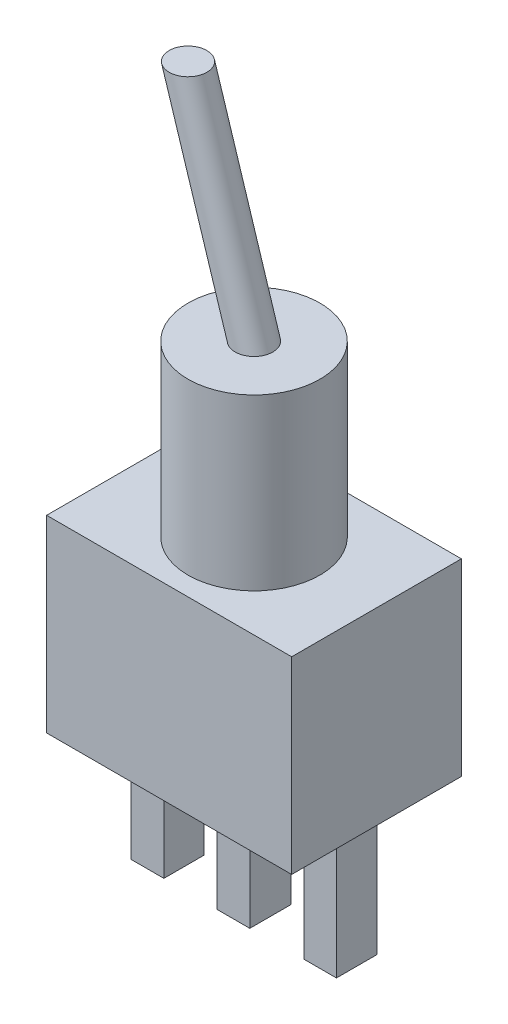
ISO-10303-21;
HEADER;
FILE_DESCRIPTION(('STEP AP214'),'2;1');
FILE_NAME('part.step','',(''),(''),'','','');
FILE_SCHEMA(('AUTOMOTIVE_DESIGN { 1 0 10303 214 1 1 1 1 }'));
ENDSEC;
DATA;
#1=APPLICATION_CONTEXT('core data for automotive mechanical design processes');
#2=APPLICATION_PROTOCOL_DEFINITION('international standard','automotive_design',2000,#1);
#3=PRODUCT_CONTEXT('',#1,'mechanical');
#4=PRODUCT('Part','Part','',(#3));
#5=PRODUCT_RELATED_PRODUCT_CATEGORY('part','',(#4));
#6=PRODUCT_DEFINITION_FORMATION('','',#4);
#7=PRODUCT_DEFINITION_CONTEXT('part definition',#1,'design');
#8=PRODUCT_DEFINITION('design','',#6,#7);
#9=PRODUCT_DEFINITION_SHAPE('','',#8);
#10=(LENGTH_UNIT() NAMED_UNIT(*) SI_UNIT(.MILLI.,.METRE.));
#11=(NAMED_UNIT(*) PLANE_ANGLE_UNIT() SI_UNIT($,.RADIAN.));
#12=(NAMED_UNIT(*) SI_UNIT($,.STERADIAN.) SOLID_ANGLE_UNIT());
#13=UNCERTAINTY_MEASURE_WITH_UNIT(LENGTH_MEASURE(1.E-05),#10,'distance_accuracy_value','');
#14=(GEOMETRIC_REPRESENTATION_CONTEXT(3) GLOBAL_UNCERTAINTY_ASSIGNED_CONTEXT((#13)) GLOBAL_UNIT_ASSIGNED_CONTEXT((#10,
#11,#12)) REPRESENTATION_CONTEXT('',''));
#15=CARTESIAN_POINT('',(0.,0.,0.));
#16=DIRECTION('',(0.,0.,1.));
#17=DIRECTION('',(1.,0.,0.));
#18=AXIS2_PLACEMENT_3D('',#15,#16,#17);
#19=CARTESIAN_POINT('',(0.,0.,0.));
#20=DIRECTION('',(0.,1.,0.));
#21=DIRECTION('',(0.,0.,1.));
#22=AXIS2_PLACEMENT_3D('',#19,#20,#21);
#23=PLANE('',#22);
#24=DIRECTION('',(0.,0.,1.));
#25=VECTOR('',#24,1.);
#26=CARTESIAN_POINT('',(-3.71007204412239,0.,1.06976152914244));
#27=LINE('',#26,#25);
#28=CARTESIAN_POINT('',(-3.71007204412239,0.,-1.06976152914244));
#29=VERTEX_POINT('',#28);
#30=CARTESIAN_POINT('',(-3.71007204412239,0.,1.06976152914244));
#31=VERTEX_POINT('',#30);
#32=EDGE_CURVE('E170',#29,#31,#27,.T.);
#33=ORIENTED_EDGE('',*,*,#32,.F.);
#34=DIRECTION('',(1.,0.,0.));
#35=VECTOR('',#34,1.);
#36=CARTESIAN_POINT('',(-3.71007204412239,0.,-1.06976152914244));
#37=LINE('',#36,#35);
#38=CARTESIAN_POINT('',(-5.44316480419965,0.,-1.06976152914244));
#39=VERTEX_POINT('',#38);
#40=EDGE_CURVE('E183',#39,#29,#37,.T.);
#41=ORIENTED_EDGE('',*,*,#40,.F.);
#42=DIRECTION('',(0.,0.,-1.));
#43=VECTOR('',#42,1.);
#44=CARTESIAN_POINT('',(-5.44316480419965,0.,1.06976152914244));
#45=LINE('',#44,#43);
#46=CARTESIAN_POINT('',(-5.44316480419965,0.,1.06976152914244));
#47=VERTEX_POINT('',#46);
#48=EDGE_CURVE('E192',#47,#39,#45,.T.);
#49=ORIENTED_EDGE('',*,*,#48,.F.);
#50=DIRECTION('',(-1.,0.,0.));
#51=VECTOR('',#50,1.);
#52=CARTESIAN_POINT('',(-3.71007204412239,0.,1.06976152914244));
#53=LINE('',#52,#51);
#54=EDGE_CURVE('E173',#31,#47,#53,.T.);
#55=ORIENTED_EDGE('',*,*,#54,.F.);
#56=EDGE_LOOP('',(#33,#41,#49,#55));
#57=FACE_BOUND('',#56,.T.);
#58=DIRECTION('',(0.,0.,-1.));
#59=VECTOR('',#58,1.);
#60=CARTESIAN_POINT('',(6.5,0.,-4.5));
#61=LINE('',#60,#59);
#62=CARTESIAN_POINT('',(6.5,0.,4.5));
#63=VERTEX_POINT('',#62);
#64=CARTESIAN_POINT('',(6.5,0.,-4.5));
#65=VERTEX_POINT('',#64);
#66=EDGE_CURVE('E247',#63,#65,#61,.T.);
#67=ORIENTED_EDGE('',*,*,#66,.F.);
#68=DIRECTION('',(1.,0.,0.));
#69=VECTOR('',#68,1.);
#70=CARTESIAN_POINT('',(-6.5,0.,4.5));
#71=LINE('',#70,#69);
#72=CARTESIAN_POINT('',(-6.5,0.,4.5));
#73=VERTEX_POINT('',#72);
#74=EDGE_CURVE('E254',#73,#63,#71,.T.);
#75=ORIENTED_EDGE('',*,*,#74,.F.);
#76=DIRECTION('',(0.,0.,1.));
#77=VECTOR('',#76,1.);
#78=CARTESIAN_POINT('',(-6.5,0.,-4.5));
#79=LINE('',#78,#77);
#80=CARTESIAN_POINT('',(-6.5,0.,-4.5));
#81=VERTEX_POINT('',#80);
#82=EDGE_CURVE('E265',#81,#73,#79,.T.);
#83=ORIENTED_EDGE('',*,*,#82,.F.);
#84=DIRECTION('',(-1.,0.,0.));
#85=VECTOR('',#84,1.);
#86=CARTESIAN_POINT('',(-6.5,0.,-4.5));
#87=LINE('',#86,#85);
#88=EDGE_CURVE('E263',#65,#81,#87,.T.);
#89=ORIENTED_EDGE('',*,*,#88,.F.);
#90=EDGE_LOOP('',(#67,#75,#83,#89));
#91=FACE_BOUND('',#90,.T.);
#92=DIRECTION('',(0.,0.,1.));
#93=VECTOR('',#92,1.);
#94=CARTESIAN_POINT('',(5.44316480419965,0.,1.06976152914244));
#95=LINE('',#94,#93);
#96=CARTESIAN_POINT('',(5.44316480419965,0.,-1.06976152914244));
#97=VERTEX_POINT('',#96);
#98=CARTESIAN_POINT('',(5.44316480419965,0.,1.06976152914244));
#99=VERTEX_POINT('',#98);
#100=EDGE_CURVE('E208',#97,#99,#95,.T.);
#101=ORIENTED_EDGE('',*,*,#100,.F.);
#102=DIRECTION('',(1.,0.,0.));
#103=VECTOR('',#102,1.);
#104=CARTESIAN_POINT('',(3.71007204412239,0.,-1.06976152914244));
#105=LINE('',#104,#103);
#106=CARTESIAN_POINT('',(3.71007204412239,0.,-1.06976152914244));
#107=VERTEX_POINT('',#106);
#108=EDGE_CURVE('E213',#107,#97,#105,.T.);
#109=ORIENTED_EDGE('',*,*,#108,.F.);
#110=DIRECTION('',(0.,0.,-1.));
#111=VECTOR('',#110,1.);
#112=CARTESIAN_POINT('',(3.71007204412239,0.,1.06976152914244));
#113=LINE('',#112,#111);
#114=CARTESIAN_POINT('',(3.71007204412239,0.,1.06976152914244));
#115=VERTEX_POINT('',#114);
#116=EDGE_CURVE('E225',#115,#107,#113,.T.);
#117=ORIENTED_EDGE('',*,*,#116,.F.);
#118=DIRECTION('',(-1.,0.,0.));
#119=VECTOR('',#118,1.);
#120=CARTESIAN_POINT('',(3.71007204412239,0.,1.06976152914244));
#121=LINE('',#120,#119);
#122=EDGE_CURVE('E222',#99,#115,#121,.T.);
#123=ORIENTED_EDGE('',*,*,#122,.F.);
#124=EDGE_LOOP('',(#101,#109,#117,#123));
#125=FACE_BOUND('',#124,.T.);
#126=DIRECTION('',(0.,0.,1.));
#127=VECTOR('',#126,1.);
#128=CARTESIAN_POINT('',(0.864683341182707,0.,1.08737475153483));
#129=LINE('',#128,#127);
#130=CARTESIAN_POINT('',(0.864683341182707,0.,-1.08737475153483));
#131=VERTEX_POINT('',#130);
#132=CARTESIAN_POINT('',(0.864683341182707,0.,1.08737475153483));
#133=VERTEX_POINT('',#132);
#134=EDGE_CURVE('E169',#131,#133,#129,.T.);
#135=ORIENTED_EDGE('',*,*,#134,.F.);
#136=DIRECTION('',(1.,0.,0.));
#137=VECTOR('',#136,1.);
#138=CARTESIAN_POINT('',(-0.864683341182707,0.,-1.08737475153483));
#139=LINE('',#138,#137);
#140=CARTESIAN_POINT('',(-0.864683341182707,0.,-1.08737475153483));
#141=VERTEX_POINT('',#140);
#142=EDGE_CURVE('E166',#141,#131,#139,.T.);
#143=ORIENTED_EDGE('',*,*,#142,.F.);
#144=DIRECTION('',(0.,0.,-1.));
#145=VECTOR('',#144,1.);
#146=CARTESIAN_POINT('',(-0.864683341182707,0.,1.08737475153483));
#147=LINE('',#146,#145);
#148=CARTESIAN_POINT('',(-0.864683341182707,0.,1.08737475153483));
#149=VERTEX_POINT('',#148);
#150=EDGE_CURVE('E56',#149,#141,#147,.T.);
#151=ORIENTED_EDGE('',*,*,#150,.F.);
#152=DIRECTION('',(-1.,0.,0.));
#153=VECTOR('',#152,1.);
#154=CARTESIAN_POINT('',(-0.864683341182707,0.,1.08737475153483));
#155=LINE('',#154,#153);
#156=EDGE_CURVE('E51',#133,#149,#155,.T.);
#157=ORIENTED_EDGE('',*,*,#156,.F.);
#158=EDGE_LOOP('',(#135,#143,#151,#157));
#159=FACE_BOUND('',#158,.T.);
#160=ADVANCED_FACE('F34',(#57,#91,#125,#159),#23,.F.);
#161=CARTESIAN_POINT('',(6.5,10.,-4.5));
#162=DIRECTION('',(-1.,0.,0.));
#163=DIRECTION('',(0.,0.,1.));
#164=AXIS2_PLACEMENT_3D('',#161,#162,#163);
#165=PLANE('',#164);
#166=ORIENTED_EDGE('',*,*,#66,.T.);
#167=DIRECTION('',(0.,-1.,0.));
#168=VECTOR('',#167,1.);
#169=CARTESIAN_POINT('',(6.5,10.,-4.5));
#170=LINE('',#169,#168);
#171=CARTESIAN_POINT('',(6.5,10.,-4.5));
#172=VERTEX_POINT('',#171);
#173=EDGE_CURVE('E38',#172,#65,#170,.T.);
#174=ORIENTED_EDGE('',*,*,#173,.F.);
#175=DIRECTION('',(0.,0.,-1.));
#176=VECTOR('',#175,1.);
#177=CARTESIAN_POINT('',(6.5,10.,-4.5));
#178=LINE('',#177,#176);
#179=CARTESIAN_POINT('',(6.5,10.,4.5));
#180=VERTEX_POINT('',#179);
#181=EDGE_CURVE('E250',#180,#172,#178,.T.);
#182=ORIENTED_EDGE('',*,*,#181,.F.);
#183=DIRECTION('',(0.,-1.,0.));
#184=VECTOR('',#183,1.);
#185=CARTESIAN_POINT('',(6.5,10.,4.5));
#186=LINE('',#185,#184);
#187=EDGE_CURVE('E260',#180,#63,#186,.T.);
#188=ORIENTED_EDGE('',*,*,#187,.T.);
#189=EDGE_LOOP('',(#166,#174,#182,#188));
#190=FACE_BOUND('',#189,.T.);
#191=ADVANCED_FACE('F36',(#190),#165,.F.);
#192=CARTESIAN_POINT('',(-6.5,10.,-4.5));
#193=DIRECTION('',(0.,0.,1.));
#194=DIRECTION('',(1.,0.,0.));
#195=AXIS2_PLACEMENT_3D('',#192,#193,#194);
#196=PLANE('',#195);
#197=ORIENTED_EDGE('',*,*,#88,.T.);
#198=DIRECTION('',(0.,-1.,0.));
#199=VECTOR('',#198,1.);
#200=CARTESIAN_POINT('',(-6.5,10.,-4.5));
#201=LINE('',#200,#199);
#202=CARTESIAN_POINT('',(-6.5,10.,-4.5));
#203=VERTEX_POINT('',#202);
#204=EDGE_CURVE('E272',#203,#81,#201,.T.);
#205=ORIENTED_EDGE('',*,*,#204,.F.);
#206=DIRECTION('',(-1.,0.,0.));
#207=VECTOR('',#206,1.);
#208=CARTESIAN_POINT('',(-6.5,10.,-4.5));
#209=LINE('',#208,#207);
#210=EDGE_CURVE('E253',#172,#203,#209,.T.);
#211=ORIENTED_EDGE('',*,*,#210,.F.);
#212=ORIENTED_EDGE('',*,*,#173,.T.);
#213=EDGE_LOOP('',(#197,#205,#211,#212));
#214=FACE_BOUND('',#213,.T.);
#215=ADVANCED_FACE('F281',(#214),#196,.F.);
#216=CARTESIAN_POINT('',(-6.5,10.,-4.5));
#217=DIRECTION('',(1.,0.,0.));
#218=DIRECTION('',(0.,0.,-1.));
#219=AXIS2_PLACEMENT_3D('',#216,#217,#218);
#220=PLANE('',#219);
#221=ORIENTED_EDGE('',*,*,#82,.T.);
#222=DIRECTION('',(0.,-1.,0.));
#223=VECTOR('',#222,1.);
#224=CARTESIAN_POINT('',(-6.5,10.,4.5));
#225=LINE('',#224,#223);
#226=CARTESIAN_POINT('',(-6.5,10.,4.5));
#227=VERTEX_POINT('',#226);
#228=EDGE_CURVE('E270',#227,#73,#225,.T.);
#229=ORIENTED_EDGE('',*,*,#228,.F.);
#230=DIRECTION('',(0.,0.,1.));
#231=VECTOR('',#230,1.);
#232=CARTESIAN_POINT('',(-6.5,10.,-4.5));
#233=LINE('',#232,#231);
#234=EDGE_CURVE('E256',#203,#227,#233,.T.);
#235=ORIENTED_EDGE('',*,*,#234,.F.);
#236=ORIENTED_EDGE('',*,*,#204,.T.);
#237=EDGE_LOOP('',(#221,#229,#235,#236));
#238=FACE_BOUND('',#237,.T.);
#239=ADVANCED_FACE('F290',(#238),#220,.F.);
#240=CARTESIAN_POINT('',(-6.5,10.,4.5));
#241=DIRECTION('',(0.,0.,-1.));
#242=DIRECTION('',(-1.,0.,0.));
#243=AXIS2_PLACEMENT_3D('',#240,#241,#242);
#244=PLANE('',#243);
#245=ORIENTED_EDGE('',*,*,#74,.T.);
#246=ORIENTED_EDGE('',*,*,#187,.F.);
#247=DIRECTION('',(1.,0.,0.));
#248=VECTOR('',#247,1.);
#249=CARTESIAN_POINT('',(-6.5,10.,4.5));
#250=LINE('',#249,#248);
#251=EDGE_CURVE('E258',#227,#180,#250,.T.);
#252=ORIENTED_EDGE('',*,*,#251,.F.);
#253=ORIENTED_EDGE('',*,*,#228,.T.);
#254=EDGE_LOOP('',(#245,#246,#252,#253));
#255=FACE_BOUND('',#254,.T.);
#256=ADVANCED_FACE('F293',(#255),#244,.F.);
#257=CARTESIAN_POINT('',(0.,10.,0.));
#258=DIRECTION('',(0.,1.,0.));
#259=DIRECTION('',(0.,0.,1.));
#260=AXIS2_PLACEMENT_3D('',#257,#258,#259);
#261=PLANE('',#260);
#262=CARTESIAN_POINT('',(0.,10.,0.));
#263=DIRECTION('',(0.,1.,0.));
#264=DIRECTION('',(0.,0.,1.));
#265=AXIS2_PLACEMENT_3D('',#262,#263,#264);
#266=CIRCLE('',#265,3.5);
#267=CARTESIAN_POINT('',(0.,10.,3.5));
#268=VERTEX_POINT('',#267);
#269=EDGE_CURVE('E43',#268,#268,#266,.T.);
#270=ORIENTED_EDGE('',*,*,#269,.F.);
#271=EDGE_LOOP('',(#270));
#272=FACE_BOUND('',#271,.T.);
#273=ORIENTED_EDGE('',*,*,#181,.T.);
#274=ORIENTED_EDGE('',*,*,#210,.T.);
#275=ORIENTED_EDGE('',*,*,#234,.T.);
#276=ORIENTED_EDGE('',*,*,#251,.T.);
#277=EDGE_LOOP('',(#273,#274,#275,#276));
#278=FACE_BOUND('',#277,.T.);
#279=ADVANCED_FACE('F295',(#272,#278),#261,.T.);
#280=CARTESIAN_POINT('',(0.,19.,0.));
#281=DIRECTION('',(0.,-1.,0.));
#282=DIRECTION('',(0.,0.,-1.));
#283=AXIS2_PLACEMENT_3D('',#280,#281,#282);
#284=CYLINDRICAL_SURFACE('',#283,3.5);
#285=CARTESIAN_POINT('',(0.,19.,0.));
#286=DIRECTION('',(0.,1.,0.));
#287=DIRECTION('',(0.,0.,1.));
#288=AXIS2_PLACEMENT_3D('',#285,#286,#287);
#289=CIRCLE('',#288,3.5);
#290=CARTESIAN_POINT('',(0.,19.,3.5));
#291=VERTEX_POINT('',#290);
#292=EDGE_CURVE('E244',#291,#291,#289,.T.);
#293=ORIENTED_EDGE('',*,*,#292,.F.);
#294=EDGE_LOOP('',(#293));
#295=FACE_BOUND('',#294,.T.);
#296=ORIENTED_EDGE('',*,*,#269,.T.);
#297=EDGE_LOOP('',(#296));
#298=FACE_BOUND('',#297,.T.);
#299=ADVANCED_FACE('F297',(#295,#298),#284,.T.);
#300=CARTESIAN_POINT('',(0.,19.,0.));
#301=DIRECTION('',(0.,1.,0.));
#302=DIRECTION('',(0.,0.,1.));
#303=AXIS2_PLACEMENT_3D('',#300,#301,#302);
#304=PLANE('',#303);
#305=CARTESIAN_POINT('',(0.,19.,0.));
#306=DIRECTION('',(0.,1.,0.));
#307=DIRECTION('',(0.,0.,1.));
#308=AXIS2_PLACEMENT_3D('',#305,#306,#307);
#309=CIRCLE('',#308,1.);
#310=CARTESIAN_POINT('',(0.,19.,1.));
#311=VERTEX_POINT('',#310);
#312=EDGE_CURVE('E11',#311,#311,#309,.T.);
#313=ORIENTED_EDGE('',*,*,#312,.F.);
#314=EDGE_LOOP('',(#313));
#315=FACE_BOUND('',#314,.T.);
#316=ORIENTED_EDGE('',*,*,#292,.T.);
#317=EDGE_LOOP('',(#316));
#318=FACE_BOUND('',#317,.T.);
#319=ADVANCED_FACE('F304',(#315,#318),#304,.T.);
#320=CARTESIAN_POINT('',(-3.5,30.1002056575858,0.));
#321=DIRECTION('',(0.,1.,0.));
#322=DIRECTION('',(0.,0.,1.));
#323=AXIS2_PLACEMENT_3D('',#320,#321,#322);
#324=PLANE('',#323);
#325=CARTESIAN_POINT('',(-3.5,30.1002056575858,0.));
#326=DIRECTION('',(0.,1.,0.));
#327=DIRECTION('',(0.,0.,1.));
#328=AXIS2_PLACEMENT_3D('',#325,#326,#327);
#329=CIRCLE('',#328,1.);
#330=CARTESIAN_POINT('',(-3.5,30.1002056575858,1.));
#331=VERTEX_POINT('',#330);
#332=EDGE_CURVE('E240',#331,#331,#329,.T.);
#333=ORIENTED_EDGE('',*,*,#332,.T.);
#334=EDGE_LOOP('',(#333));
#335=FACE_BOUND('',#334,.T.);
#336=ADVANCED_FACE('F349',(#335),#324,.T.);
#337=CARTESIAN_POINT('',(0.,19.,1.));
#338=CARTESIAN_POINT('',(-3.5,30.1002056575858,1.));
#339=CARTESIAN_POINT('',(2.,19.,1.));
#340=CARTESIAN_POINT('',(-1.5,30.1002056575858,1.));
#341=CARTESIAN_POINT('',(2.,19.,-1.));
#342=CARTESIAN_POINT('',(-1.5,30.1002056575858,-1.));
#343=CARTESIAN_POINT('',(0.,19.,-1.));
#344=CARTESIAN_POINT('',(-3.5,30.1002056575858,-1.));
#345=CARTESIAN_POINT('',(-2.,19.,-1.));
#346=CARTESIAN_POINT('',(-5.5,30.1002056575858,-1.));
#347=CARTESIAN_POINT('',(-2.,19.,1.));
#348=CARTESIAN_POINT('',(-5.5,30.1002056575858,1.));
#349=CARTESIAN_POINT('',(0.,19.,1.));
#350=CARTESIAN_POINT('',(-3.5,30.1002056575858,1.));
#351=(BOUNDED_SURFACE() B_SPLINE_SURFACE(3,1,((#337,#338),(#339,#340),(#341,#342),(#343,#344),
(#345,#346),(#347,#348),(#349,#350)),.UNSPECIFIED.,.T.,.F.,.F.) B_SPLINE_SURFACE_WITH_KNOTS((4,
3,4),(2,2),(0.,0.5,1.),(0.,1.),
.UNSPECIFIED.) GEOMETRIC_REPRESENTATION_ITEM() RATIONAL_B_SPLINE_SURFACE(((1.,1.),
(0.333333333333333,0.333333333333333),(0.333333333333333,0.333333333333333),(1.,1.),
(0.333333333333333,0.333333333333333),(0.333333333333333,0.333333333333333),(1.,1.))) REPRESENTATION_ITEM('') SURFACE());
#352=CARTESIAN_POINT('',(-3.5,30.1002056575858,1.));
#353=CARTESIAN_POINT('',(-3.46354166666667,29.9845785153193,1.));
#354=CARTESIAN_POINT('',(-3.42708333333333,29.8689513730528,1.));
#355=CARTESIAN_POINT('',(-3.35416666666667,29.6376970885198,1.));
#356=CARTESIAN_POINT('',(-3.31770833333333,29.5220699462532,1.));
#357=CARTESIAN_POINT('',(-3.24479166666667,29.2908156617202,1.));
#358=CARTESIAN_POINT('',(-3.20833333333333,29.1751885194537,1.));
#359=CARTESIAN_POINT('',(-3.13541666666667,28.9439342349206,1.));
#360=CARTESIAN_POINT('',(-3.09895833333333,28.8283070926541,1.));
#361=CARTESIAN_POINT('',(-3.02604166666667,28.5970528081211,1.));
#362=CARTESIAN_POINT('',(-2.98958333333333,28.4814256658546,1.));
#363=CARTESIAN_POINT('',(-2.91666666666667,28.2501713813215,1.));
#364=CARTESIAN_POINT('',(-2.88020833333333,28.134544239055,1.));
#365=CARTESIAN_POINT('',(-2.80729166666667,27.903289954522,1.));
#366=CARTESIAN_POINT('',(-2.77083333333333,27.7876628122555,1.));
#367=CARTESIAN_POINT('',(-2.69791666666667,27.5564085277224,1.));
#368=CARTESIAN_POINT('',(-2.66145833333333,27.4407813854559,1.));
#369=CARTESIAN_POINT('',(-2.58854166666667,27.2095271009229,1.));
#370=CARTESIAN_POINT('',(-2.55208333333333,27.0938999586563,1.));
#371=CARTESIAN_POINT('',(-2.47916666666667,26.8626456741233,1.));
#372=CARTESIAN_POINT('',(-2.44270833333333,26.7470185318568,1.));
#373=CARTESIAN_POINT('',(-2.36979166666667,26.5157642473237,1.));
#374=CARTESIAN_POINT('',(-2.33333333333333,26.4001371050572,1.));
#375=CARTESIAN_POINT('',(-2.26041666666667,26.1688828205242,1.));
#376=CARTESIAN_POINT('',(-2.22395833333333,26.0532556782577,1.));
#377=CARTESIAN_POINT('',(-2.15104166666667,25.8220013937246,1.));
#378=CARTESIAN_POINT('',(-2.11458333333333,25.7063742514581,1.));
#379=CARTESIAN_POINT('',(-2.04166666666667,25.4751199669251,1.));
#380=CARTESIAN_POINT('',(-2.00520833333333,25.3594928246586,1.));
#381=CARTESIAN_POINT('',(-1.93229166666667,25.1282385401255,1.));
#382=CARTESIAN_POINT('',(-1.89583333333333,25.012611397859,1.));
#383=CARTESIAN_POINT('',(-1.82291666666667,24.781357113326,1.));
#384=CARTESIAN_POINT('',(-1.78645833333333,24.6657299710594,1.));
#385=CARTESIAN_POINT('',(-1.71354166666667,24.4344756865264,1.));
#386=CARTESIAN_POINT('',(-1.67708333333333,24.3188485442599,1.));
#387=CARTESIAN_POINT('',(-1.60416666666667,24.0875942597268,1.));
#388=CARTESIAN_POINT('',(-1.56770833333333,23.9719671174603,1.));
#389=CARTESIAN_POINT('',(-1.49479166666667,23.7407128329273,1.));
#390=CARTESIAN_POINT('',(-1.45833333333333,23.6250856906608,1.));
#391=CARTESIAN_POINT('',(-1.38541666666667,23.3938314061277,1.));
#392=CARTESIAN_POINT('',(-1.34895833333333,23.2782042638612,1.));
#393=CARTESIAN_POINT('',(-1.27604166666667,23.0469499793282,1.));
#394=CARTESIAN_POINT('',(-1.23958333333333,22.9313228370616,1.));
#395=CARTESIAN_POINT('',(-1.16666666666667,22.7000685525286,1.));
#396=CARTESIAN_POINT('',(-1.13020833333333,22.5844414102621,1.));
#397=CARTESIAN_POINT('',(-1.05729166666667,22.3531871257291,1.));
#398=CARTESIAN_POINT('',(-1.02083333333333,22.2375599834625,1.));
#399=CARTESIAN_POINT('',(-0.947916666666666,22.0063056989295,1.));
#400=CARTESIAN_POINT('',(-0.911458333333333,21.890678556663,1.));
#401=CARTESIAN_POINT('',(-0.838541666666667,21.6594242721299,1.));
#402=CARTESIAN_POINT('',(-0.802083333333333,21.5437971298634,1.));
#403=CARTESIAN_POINT('',(-0.729166666666667,21.3125428453304,1.));
#404=CARTESIAN_POINT('',(-0.692708333333334,21.1969157030639,1.));
#405=CARTESIAN_POINT('',(-0.619791666666667,20.9656614185308,1.));
#406=CARTESIAN_POINT('',(-0.583333333333333,20.8500342762643,1.));
#407=CARTESIAN_POINT('',(-0.510416666666666,20.6187799917313,1.));
#408=CARTESIAN_POINT('',(-0.473958333333333,20.5031528494647,1.));
#409=CARTESIAN_POINT('',(-0.401041666666667,20.2718985649317,1.));
#410=CARTESIAN_POINT('',(-0.364583333333333,20.1562714226652,1.));
#411=CARTESIAN_POINT('',(-0.291666666666667,19.9250171381322,1.));
#412=CARTESIAN_POINT('',(-0.255208333333334,19.8093899958656,1.));
#413=CARTESIAN_POINT('',(-0.182291666666667,19.5781357113326,1.));
#414=CARTESIAN_POINT('',(-0.145833333333333,19.4625085690661,1.));
#415=CARTESIAN_POINT('',(-0.0729166666666664,19.231254284533,1.));
#416=CARTESIAN_POINT('',(-0.0364583333333329,19.1156271422665,1.));
#417=CARTESIAN_POINT('',(0.,19.,1.));
#418=B_SPLINE_CURVE_WITH_KNOTS('',3,(#352,#353,#354,#355,#356,#357,#358,#359,#360,#361,#362,
#363,#364,#365,#366,#367,#368,#369,#370,#371,#372,#373,#374,#375,#376,#377,#378,#379,#380,#381,
#382,#383,#384,#385,#386,#387,#388,#389,#390,#391,#392,#393,#394,#395,#396,#397,#398,#399,#400,
#401,#402,#403,#404,#405,#406,#407,#408,#409,#410,#411,#412,#413,#414,#415,#416,#417),
.UNSPECIFIED.,.F.,.F.,(4,2,2,2,2,2,2,2,2,2,2,2,2,2,2,2,2,2,2,2,2,2,2,2,2,2,2,2,2,2,2,2,4),(0.,
0.363716393476424,0.727432786952848,1.09114918042927,1.4548655739057,1.81858196738212,
2.18229836085854,2.54601475433496,2.90973114781139,3.27344754128781,3.63716393476424,
4.00088032824066,4.36459672171709,4.72831311519351,5.09202950866993,5.45574590214636,
5.81946229562278,6.18317868909921,6.54689508257563,6.91061147605205,7.27432786952848,
7.6380442630049,8.00176065648132,8.36547704995775,8.72919344343417,9.0929098369106,
9.45662623038702,9.82034262386344,10.1840590173399,10.5477754108163,10.9114918042927,
11.2752081977691,11.6389245912456),.UNSPECIFIED.);
#419=EDGE_CURVE('',#331,#311,#418,.T.);
#420=ORIENTED_EDGE('',*,*,#332,.F.);
#421=ORIENTED_EDGE('',*,*,#312,.T.);
#422=ORIENTED_EDGE('',*,*,#419,.T.);
#423=ORIENTED_EDGE('',*,*,#419,.F.);
#424=EDGE_LOOP('',(#420,#422,#421,#423));
#425=FACE_BOUND('',#424,.T.);
#426=ADVANCED_FACE('F352',(#425),#351,.T.);
#427=CARTESIAN_POINT('',(5.44316480419965,-7.,1.06976152914244));
#428=DIRECTION('',(-1.,0.,0.));
#429=DIRECTION('',(0.,0.,1.));
#430=AXIS2_PLACEMENT_3D('',#427,#428,#429);
#431=PLANE('',#430);
#432=ORIENTED_EDGE('',*,*,#100,.T.);
#433=DIRECTION('',(0.,1.,0.));
#434=VECTOR('',#433,1.);
#435=CARTESIAN_POINT('',(5.44316480419965,-7.,1.06976152914244));
#436=LINE('',#435,#434);
#437=CARTESIAN_POINT('',(5.44316480419965,-7.,1.06976152914244));
#438=VERTEX_POINT('',#437);
#439=EDGE_CURVE('E238',#438,#99,#436,.T.);
#440=ORIENTED_EDGE('',*,*,#439,.F.);
#441=DIRECTION('',(0.,0.,1.));
#442=VECTOR('',#441,1.);
#443=CARTESIAN_POINT('',(5.44316480419965,-7.,1.06976152914244));
#444=LINE('',#443,#442);
#445=CARTESIAN_POINT('',(5.44316480419965,-7.,-1.06976152914244));
#446=VERTEX_POINT('',#445);
#447=EDGE_CURVE('E209',#446,#438,#444,.T.);
#448=ORIENTED_EDGE('',*,*,#447,.F.);
#449=DIRECTION('',(0.,1.,0.));
#450=VECTOR('',#449,1.);
#451=CARTESIAN_POINT('',(5.44316480419965,-7.,-1.06976152914244));
#452=LINE('',#451,#450);
#453=EDGE_CURVE('E219',#446,#97,#452,.T.);
#454=ORIENTED_EDGE('',*,*,#453,.T.);
#455=EDGE_LOOP('',(#432,#440,#448,#454));
#456=FACE_BOUND('',#455,.T.);
#457=ADVANCED_FACE('F362',(#456),#431,.F.);
#458=CARTESIAN_POINT('',(3.71007204412239,-7.,1.06976152914244));
#459=DIRECTION('',(0.,0.,-1.));
#460=DIRECTION('',(-1.,0.,0.));
#461=AXIS2_PLACEMENT_3D('',#458,#459,#460);
#462=PLANE('',#461);
#463=ORIENTED_EDGE('',*,*,#122,.T.);
#464=DIRECTION('',(0.,1.,0.));
#465=VECTOR('',#464,1.);
#466=CARTESIAN_POINT('',(3.71007204412239,-7.,1.06976152914244));
#467=LINE('',#466,#465);
#468=CARTESIAN_POINT('',(3.71007204412239,-7.,1.06976152914244));
#469=VERTEX_POINT('',#468);
#470=EDGE_CURVE('E235',#469,#115,#467,.T.);
#471=ORIENTED_EDGE('',*,*,#470,.F.);
#472=DIRECTION('',(-1.,0.,0.));
#473=VECTOR('',#472,1.);
#474=CARTESIAN_POINT('',(3.71007204412239,-7.,1.06976152914244));
#475=LINE('',#474,#473);
#476=EDGE_CURVE('E212',#438,#469,#475,.T.);
#477=ORIENTED_EDGE('',*,*,#476,.F.);
#478=ORIENTED_EDGE('',*,*,#439,.T.);
#479=EDGE_LOOP('',(#463,#471,#477,#478));
#480=FACE_BOUND('',#479,.T.);
#481=ADVANCED_FACE('F383',(#480),#462,.F.);
#482=CARTESIAN_POINT('',(3.71007204412239,-7.,1.06976152914244));
#483=DIRECTION('',(1.,0.,0.));
#484=DIRECTION('',(0.,0.,-1.));
#485=AXIS2_PLACEMENT_3D('',#482,#483,#484);
#486=PLANE('',#485);
#487=ORIENTED_EDGE('',*,*,#116,.T.);
#488=DIRECTION('',(0.,1.,0.));
#489=VECTOR('',#488,1.);
#490=CARTESIAN_POINT('',(3.71007204412239,-7.,-1.06976152914244));
#491=LINE('',#490,#489);
#492=CARTESIAN_POINT('',(3.71007204412239,-7.,-1.06976152914244));
#493=VERTEX_POINT('',#492);
#494=EDGE_CURVE('E232',#493,#107,#491,.T.);
#495=ORIENTED_EDGE('',*,*,#494,.F.);
#496=DIRECTION('',(0.,0.,-1.));
#497=VECTOR('',#496,1.);
#498=CARTESIAN_POINT('',(3.71007204412239,-7.,1.06976152914244));
#499=LINE('',#498,#497);
#500=EDGE_CURVE('E215',#469,#493,#499,.T.);
#501=ORIENTED_EDGE('',*,*,#500,.F.);
#502=ORIENTED_EDGE('',*,*,#470,.T.);
#503=EDGE_LOOP('',(#487,#495,#501,#502));
#504=FACE_BOUND('',#503,.T.);
#505=ADVANCED_FACE('F393',(#504),#486,.F.);
#506=CARTESIAN_POINT('',(3.71007204412239,-7.,-1.06976152914244));
#507=DIRECTION('',(0.,0.,1.));
#508=DIRECTION('',(1.,0.,0.));
#509=AXIS2_PLACEMENT_3D('',#506,#507,#508);
#510=PLANE('',#509);
#511=ORIENTED_EDGE('',*,*,#108,.T.);
#512=ORIENTED_EDGE('',*,*,#453,.F.);
#513=DIRECTION('',(1.,0.,0.));
#514=VECTOR('',#513,1.);
#515=CARTESIAN_POINT('',(3.71007204412239,-7.,-1.06976152914244));
#516=LINE('',#515,#514);
#517=EDGE_CURVE('E217',#493,#446,#516,.T.);
#518=ORIENTED_EDGE('',*,*,#517,.F.);
#519=ORIENTED_EDGE('',*,*,#494,.T.);
#520=EDGE_LOOP('',(#511,#512,#518,#519));
#521=FACE_BOUND('',#520,.T.);
#522=ADVANCED_FACE('F403',(#521),#510,.F.);
#523=CARTESIAN_POINT('',(0.,-7.,0.));
#524=DIRECTION('',(0.,-1.,0.));
#525=DIRECTION('',(0.,0.,-1.));
#526=AXIS2_PLACEMENT_3D('',#523,#524,#525);
#527=PLANE('',#526);
#528=ORIENTED_EDGE('',*,*,#447,.T.);
#529=ORIENTED_EDGE('',*,*,#476,.T.);
#530=ORIENTED_EDGE('',*,*,#500,.T.);
#531=ORIENTED_EDGE('',*,*,#517,.T.);
#532=EDGE_LOOP('',(#528,#529,#530,#531));
#533=FACE_BOUND('',#532,.T.);
#534=ADVANCED_FACE('F413',(#533),#527,.T.);
#535=CARTESIAN_POINT('',(-3.71007204412239,-7.,1.06976152914244));
#536=DIRECTION('',(-1.,0.,0.));
#537=DIRECTION('',(0.,0.,1.));
#538=AXIS2_PLACEMENT_3D('',#535,#536,#537);
#539=PLANE('',#538);
#540=ORIENTED_EDGE('',*,*,#32,.T.);
#541=DIRECTION('',(0.,1.,0.));
#542=VECTOR('',#541,1.);
#543=CARTESIAN_POINT('',(-3.71007204412239,-7.,1.06976152914244));
#544=LINE('',#543,#542);
#545=CARTESIAN_POINT('',(-3.71007204412239,-7.,1.06976152914244));
#546=VERTEX_POINT('',#545);
#547=EDGE_CURVE('E205',#546,#31,#544,.T.);
#548=ORIENTED_EDGE('',*,*,#547,.F.);
#549=DIRECTION('',(0.,0.,1.));
#550=VECTOR('',#549,1.);
#551=CARTESIAN_POINT('',(-3.71007204412239,-7.,1.06976152914244));
#552=LINE('',#551,#550);
#553=CARTESIAN_POINT('',(-3.71007204412239,-7.,-1.06976152914244));
#554=VERTEX_POINT('',#553);
#555=EDGE_CURVE('E179',#554,#546,#552,.T.);
#556=ORIENTED_EDGE('',*,*,#555,.F.);
#557=DIRECTION('',(0.,1.,0.));
#558=VECTOR('',#557,1.);
#559=CARTESIAN_POINT('',(-3.71007204412239,-7.,-1.06976152914244));
#560=LINE('',#559,#558);
#561=EDGE_CURVE('E188',#554,#29,#560,.T.);
#562=ORIENTED_EDGE('',*,*,#561,.T.);
#563=EDGE_LOOP('',(#540,#548,#556,#562));
#564=FACE_BOUND('',#563,.T.);
#565=ADVANCED_FACE('F423',(#564),#539,.F.);
#566=CARTESIAN_POINT('',(-3.71007204412239,-7.,1.06976152914244));
#567=DIRECTION('',(0.,0.,-1.));
#568=DIRECTION('',(-1.,0.,0.));
#569=AXIS2_PLACEMENT_3D('',#566,#567,#568);
#570=PLANE('',#569);
#571=ORIENTED_EDGE('',*,*,#54,.T.);
#572=DIRECTION('',(0.,1.,0.));
#573=VECTOR('',#572,1.);
#574=CARTESIAN_POINT('',(-5.44316480419965,-7.,1.06976152914244));
#575=LINE('',#574,#573);
#576=CARTESIAN_POINT('',(-5.44316480419965,-7.,1.06976152914244));
#577=VERTEX_POINT('',#576);
#578=EDGE_CURVE('E202',#577,#47,#575,.T.);
#579=ORIENTED_EDGE('',*,*,#578,.F.);
#580=DIRECTION('',(-1.,0.,0.));
#581=VECTOR('',#580,1.);
#582=CARTESIAN_POINT('',(-3.71007204412239,-7.,1.06976152914244));
#583=LINE('',#582,#581);
#584=EDGE_CURVE('E182',#546,#577,#583,.T.);
#585=ORIENTED_EDGE('',*,*,#584,.F.);
#586=ORIENTED_EDGE('',*,*,#547,.T.);
#587=EDGE_LOOP('',(#571,#579,#585,#586));
#588=FACE_BOUND('',#587,.T.);
#589=ADVANCED_FACE('F433',(#588),#570,.F.);
#590=CARTESIAN_POINT('',(-5.44316480419965,-7.,1.06976152914244));
#591=DIRECTION('',(1.,0.,0.));
#592=DIRECTION('',(0.,0.,-1.));
#593=AXIS2_PLACEMENT_3D('',#590,#591,#592);
#594=PLANE('',#593);
#595=ORIENTED_EDGE('',*,*,#48,.T.);
#596=DIRECTION('',(0.,1.,0.));
#597=VECTOR('',#596,1.);
#598=CARTESIAN_POINT('',(-5.44316480419965,-7.,-1.06976152914244));
#599=LINE('',#598,#597);
#600=CARTESIAN_POINT('',(-5.44316480419965,-7.,-1.06976152914244));
#601=VERTEX_POINT('',#600);
#602=EDGE_CURVE('E199',#601,#39,#599,.T.);
#603=ORIENTED_EDGE('',*,*,#602,.F.);
#604=DIRECTION('',(0.,0.,-1.));
#605=VECTOR('',#604,1.);
#606=CARTESIAN_POINT('',(-5.44316480419965,-7.,1.06976152914244));
#607=LINE('',#606,#605);
#608=EDGE_CURVE('E185',#577,#601,#607,.T.);
#609=ORIENTED_EDGE('',*,*,#608,.F.);
#610=ORIENTED_EDGE('',*,*,#578,.T.);
#611=EDGE_LOOP('',(#595,#603,#609,#610));
#612=FACE_BOUND('',#611,.T.);
#613=ADVANCED_FACE('F443',(#612),#594,.F.);
#614=CARTESIAN_POINT('',(-3.71007204412239,-7.,-1.06976152914244));
#615=DIRECTION('',(0.,0.,1.));
#616=DIRECTION('',(1.,0.,0.));
#617=AXIS2_PLACEMENT_3D('',#614,#615,#616);
#618=PLANE('',#617);
#619=ORIENTED_EDGE('',*,*,#40,.T.);
#620=ORIENTED_EDGE('',*,*,#561,.F.);
#621=DIRECTION('',(1.,0.,0.));
#622=VECTOR('',#621,1.);
#623=CARTESIAN_POINT('',(-3.71007204412239,-7.,-1.06976152914244));
#624=LINE('',#623,#622);
#625=EDGE_CURVE('E187',#601,#554,#624,.T.);
#626=ORIENTED_EDGE('',*,*,#625,.F.);
#627=ORIENTED_EDGE('',*,*,#602,.T.);
#628=EDGE_LOOP('',(#619,#620,#626,#627));
#629=FACE_BOUND('',#628,.T.);
#630=ADVANCED_FACE('F453',(#629),#618,.F.);
#631=CARTESIAN_POINT('',(0.,-7.,0.));
#632=DIRECTION('',(0.,1.,0.));
#633=DIRECTION('',(0.,0.,1.));
#634=AXIS2_PLACEMENT_3D('',#631,#632,#633);
#635=PLANE('',#634);
#636=ORIENTED_EDGE('',*,*,#555,.T.);
#637=ORIENTED_EDGE('',*,*,#584,.T.);
#638=ORIENTED_EDGE('',*,*,#608,.T.);
#639=ORIENTED_EDGE('',*,*,#625,.T.);
#640=EDGE_LOOP('',(#636,#637,#638,#639));
#641=FACE_BOUND('',#640,.T.);
#642=ADVANCED_FACE('F463',(#641),#635,.F.);
#643=CARTESIAN_POINT('',(0.864683341182707,-7.,1.08737475153483));
#644=DIRECTION('',(-1.,0.,0.));
#645=DIRECTION('',(0.,0.,1.));
#646=AXIS2_PLACEMENT_3D('',#643,#644,#645);
#647=PLANE('',#646);
#648=ORIENTED_EDGE('',*,*,#134,.T.);
#649=DIRECTION('',(0.,1.,0.));
#650=VECTOR('',#649,1.);
#651=CARTESIAN_POINT('',(0.864683341182707,-7.,1.08737475153483));
#652=LINE('',#651,#650);
#653=CARTESIAN_POINT('',(0.864683341182707,-7.,1.08737475153483));
#654=VERTEX_POINT('',#653);
#655=EDGE_CURVE('E150',#654,#133,#652,.T.);
#656=ORIENTED_EDGE('',*,*,#655,.F.);
#657=DIRECTION('',(0.,0.,1.));
#658=VECTOR('',#657,1.);
#659=CARTESIAN_POINT('',(0.864683341182707,-7.,1.08737475153483));
#660=LINE('',#659,#658);
#661=CARTESIAN_POINT('',(0.864683341182707,-7.,-1.08737475153483));
#662=VERTEX_POINT('',#661);
#663=EDGE_CURVE('E157',#662,#654,#660,.T.);
#664=ORIENTED_EDGE('',*,*,#663,.F.);
#665=DIRECTION('',(0.,1.,0.));
#666=VECTOR('',#665,1.);
#667=CARTESIAN_POINT('',(0.864683341182707,-7.,-1.08737475153483));
#668=LINE('',#667,#666);
#669=EDGE_CURVE('E530',#662,#131,#668,.T.);
#670=ORIENTED_EDGE('',*,*,#669,.T.);
#671=EDGE_LOOP('',(#648,#656,#664,#670));
#672=FACE_BOUND('',#671,.T.);
#673=ADVANCED_FACE('F168',(#672),#647,.F.);
#674=CARTESIAN_POINT('',(-0.864683341182707,-7.,1.08737475153483));
#675=DIRECTION('',(0.,0.,-1.));
#676=DIRECTION('',(-1.,0.,0.));
#677=AXIS2_PLACEMENT_3D('',#674,#675,#676);
#678=PLANE('',#677);
#679=ORIENTED_EDGE('',*,*,#156,.T.);
#680=DIRECTION('',(0.,1.,0.));
#681=VECTOR('',#680,1.);
#682=CARTESIAN_POINT('',(-0.864683341182707,-7.,1.08737475153483));
#683=LINE('',#682,#681);
#684=CARTESIAN_POINT('',(-0.864683341182707,-7.,1.08737475153483));
#685=VERTEX_POINT('',#684);
#686=EDGE_CURVE('E153',#685,#149,#683,.T.);
#687=ORIENTED_EDGE('',*,*,#686,.F.);
#688=DIRECTION('',(-1.,0.,0.));
#689=VECTOR('',#688,1.);
#690=CARTESIAN_POINT('',(-0.864683341182707,-7.,1.08737475153483));
#691=LINE('',#690,#689);
#692=EDGE_CURVE('E146',#654,#685,#691,.T.);
#693=ORIENTED_EDGE('',*,*,#692,.F.);
#694=ORIENTED_EDGE('',*,*,#655,.T.);
#695=EDGE_LOOP('',(#679,#687,#693,#694));
#696=FACE_BOUND('',#695,.T.);
#697=ADVANCED_FACE('F148',(#696),#678,.F.);
#698=CARTESIAN_POINT('',(-0.864683341182707,-7.,1.08737475153483));
#699=DIRECTION('',(1.,0.,0.));
#700=DIRECTION('',(0.,0.,-1.));
#701=AXIS2_PLACEMENT_3D('',#698,#699,#700);
#702=PLANE('',#701);
#703=ORIENTED_EDGE('',*,*,#150,.T.);
#704=DIRECTION('',(0.,1.,0.));
#705=VECTOR('',#704,1.);
#706=CARTESIAN_POINT('',(-0.864683341182707,-7.,-1.08737475153483));
#707=LINE('',#706,#705);
#708=CARTESIAN_POINT('',(-0.864683341182707,-7.,-1.08737475153483));
#709=VERTEX_POINT('',#708);
#710=EDGE_CURVE('E175',#709,#141,#707,.T.);
#711=ORIENTED_EDGE('',*,*,#710,.F.);
#712=DIRECTION('',(0.,0.,-1.));
#713=VECTOR('',#712,1.);
#714=CARTESIAN_POINT('',(-0.864683341182707,-7.,1.08737475153483));
#715=LINE('',#714,#713);
#716=EDGE_CURVE('E156',#685,#709,#715,.T.);
#717=ORIENTED_EDGE('',*,*,#716,.F.);
#718=ORIENTED_EDGE('',*,*,#686,.T.);
#719=EDGE_LOOP('',(#703,#711,#717,#718));
#720=FACE_BOUND('',#719,.T.);
#721=ADVANCED_FACE('F490',(#720),#702,.F.);
#722=CARTESIAN_POINT('',(-0.864683341182707,-7.,-1.08737475153483));
#723=DIRECTION('',(0.,0.,1.));
#724=DIRECTION('',(1.,0.,0.));
#725=AXIS2_PLACEMENT_3D('',#722,#723,#724);
#726=PLANE('',#725);
#727=ORIENTED_EDGE('',*,*,#142,.T.);
#728=ORIENTED_EDGE('',*,*,#669,.F.);
#729=DIRECTION('',(1.,0.,0.));
#730=VECTOR('',#729,1.);
#731=CARTESIAN_POINT('',(-0.864683341182707,-7.,-1.08737475153483));
#732=LINE('',#731,#730);
#733=EDGE_CURVE('E162',#709,#662,#732,.T.);
#734=ORIENTED_EDGE('',*,*,#733,.F.);
#735=ORIENTED_EDGE('',*,*,#710,.T.);
#736=EDGE_LOOP('',(#727,#728,#734,#735));
#737=FACE_BOUND('',#736,.T.);
#738=ADVANCED_FACE('F499',(#737),#726,.F.);
#739=CARTESIAN_POINT('',(0.,-7.,0.));
#740=DIRECTION('',(0.,-1.,0.));
#741=DIRECTION('',(0.,0.,-1.));
#742=AXIS2_PLACEMENT_3D('',#739,#740,#741);
#743=PLANE('',#742);
#744=ORIENTED_EDGE('',*,*,#663,.T.);
#745=ORIENTED_EDGE('',*,*,#692,.T.);
#746=ORIENTED_EDGE('',*,*,#716,.T.);
#747=ORIENTED_EDGE('',*,*,#733,.T.);
#748=EDGE_LOOP('',(#744,#745,#746,#747));
#749=FACE_BOUND('',#748,.T.);
#750=ADVANCED_FACE('F160',(#749),#743,.T.);
#751=CLOSED_SHELL('',(#160,#191,#215,#239,#256,#279,#299,#319,#336,#426,#457,#481,#505,#522,
#534,#565,#589,#613,#630,#642,#673,#697,#721,#738,#750));
#752=MANIFOLD_SOLID_BREP('B2',#751);
#753=ADVANCED_BREP_SHAPE_REPRESENTATION('',(#18,#752),#14);
#754=SHAPE_DEFINITION_REPRESENTATION(#9,#753);
ENDSEC;
END-ISO-10303-21;
